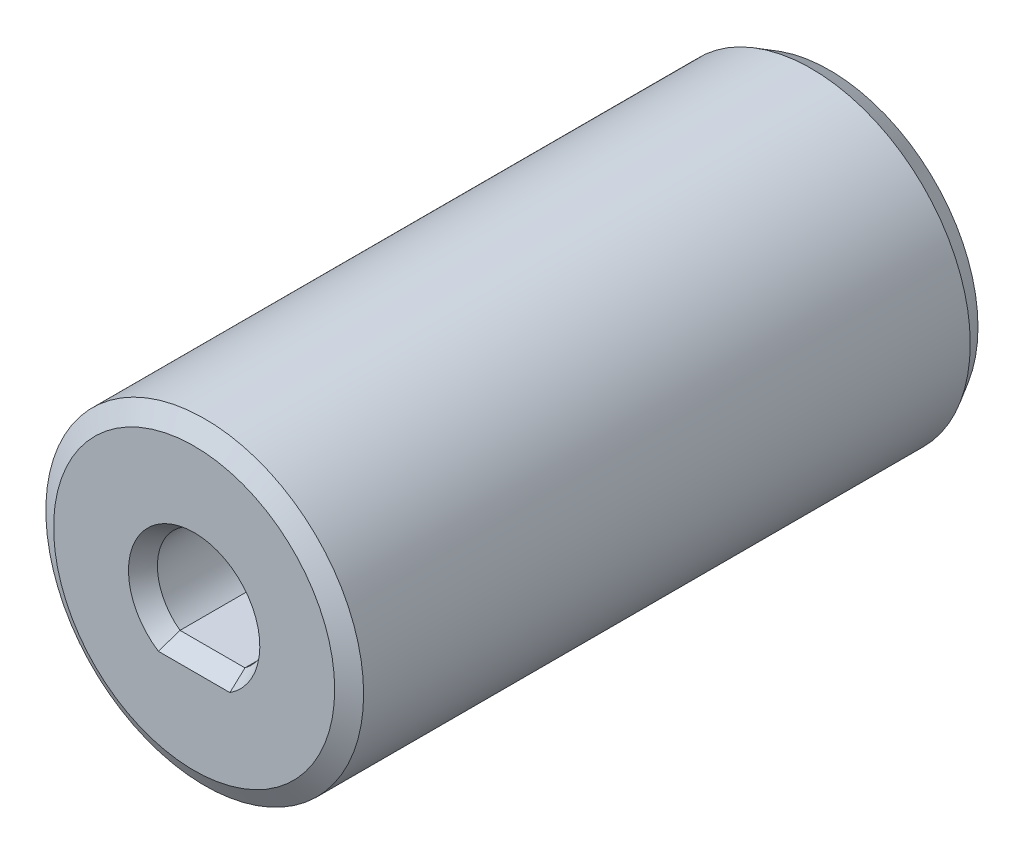
ISO-10303-21;
HEADER;
FILE_DESCRIPTION(('STEP AP214'),'2;1');
FILE_NAME('part.step','',(''),(''),'','','');
FILE_SCHEMA(('AUTOMOTIVE_DESIGN { 1 0 10303 214 1 1 1 1 }'));
ENDSEC;
DATA;
#1=APPLICATION_CONTEXT('core data for automotive mechanical design processes');
#2=APPLICATION_PROTOCOL_DEFINITION('international standard','automotive_design',2000,#1);
#3=PRODUCT_CONTEXT('',#1,'mechanical');
#4=PRODUCT('Part','Part','',(#3));
#5=PRODUCT_RELATED_PRODUCT_CATEGORY('part','',(#4));
#6=PRODUCT_DEFINITION_FORMATION('','',#4);
#7=PRODUCT_DEFINITION_CONTEXT('part definition',#1,'design');
#8=PRODUCT_DEFINITION('design','',#6,#7);
#9=PRODUCT_DEFINITION_SHAPE('','',#8);
#10=(LENGTH_UNIT() NAMED_UNIT(*) SI_UNIT(.MILLI.,.METRE.));
#11=(NAMED_UNIT(*) PLANE_ANGLE_UNIT() SI_UNIT($,.RADIAN.));
#12=(NAMED_UNIT(*) SI_UNIT($,.STERADIAN.) SOLID_ANGLE_UNIT());
#13=UNCERTAINTY_MEASURE_WITH_UNIT(LENGTH_MEASURE(1.E-05),#10,'distance_accuracy_value','');
#14=(GEOMETRIC_REPRESENTATION_CONTEXT(3) GLOBAL_UNCERTAINTY_ASSIGNED_CONTEXT((#13)) GLOBAL_UNIT_ASSIGNED_CONTEXT((#10,
#11,#12)) REPRESENTATION_CONTEXT('',''));
#15=CARTESIAN_POINT('',(0.,0.,0.));
#16=DIRECTION('',(0.,0.,1.));
#17=DIRECTION('',(1.,0.,0.));
#18=AXIS2_PLACEMENT_3D('',#15,#16,#17);
#19=CARTESIAN_POINT('',(0.,0.,0.));
#20=DIRECTION('',(0.,0.,1.));
#21=DIRECTION('',(1.,0.,0.));
#22=AXIS2_PLACEMENT_3D('',#19,#20,#21);
#23=PLANE('',#22);
#24=CARTESIAN_POINT('',(0.,0.,0.));
#25=DIRECTION('',(0.,0.,1.));
#26=DIRECTION('',(1.,0.,0.));
#27=AXIS2_PLACEMENT_3D('',#24,#25,#26);
#28=CIRCLE('',#27,6.99999999999999);
#29=CARTESIAN_POINT('',(6.99999999999999,0.,0.));
#30=VERTEX_POINT('',#29);
#31=EDGE_CURVE('E173',#30,#30,#28,.F.);
#32=ORIENTED_EDGE('',*,*,#31,.T.);
#33=EDGE_LOOP('',(#32));
#34=FACE_BOUND('',#33,.T.);
#35=CARTESIAN_POINT('',(0.,0.,0.));
#36=DIRECTION('',(0.,0.,1.));
#37=DIRECTION('',(1.,0.,0.));
#38=AXIS2_PLACEMENT_3D('',#35,#36,#37);
#39=CIRCLE('',#38,5.81602540378444);
#40=CARTESIAN_POINT('',(5.81602540378444,0.,0.));
#41=VERTEX_POINT('',#40);
#42=EDGE_CURVE('E170',#41,#41,#39,.T.);
#43=ORIENTED_EDGE('',*,*,#42,.T.);
#44=EDGE_LOOP('',(#43));
#45=FACE_BOUND('',#44,.T.);
#46=ADVANCED_FACE('F35',(#34,#45),#23,.F.);
#47=CARTESIAN_POINT('',(0.,0.,30.));
#48=DIRECTION('',(0.,0.,-1.));
#49=DIRECTION('',(-1.,0.,0.));
#50=AXIS2_PLACEMENT_3D('',#47,#48,#49);
#51=CYLINDRICAL_SURFACE('',#50,7.5);
#52=CARTESIAN_POINT('',(0.,0.,29.5));
#53=DIRECTION('',(0.,0.,1.));
#54=DIRECTION('',(1.,0.,0.));
#55=AXIS2_PLACEMENT_3D('',#52,#53,#54);
#56=CIRCLE('',#55,7.5);
#57=CARTESIAN_POINT('',(7.5,0.,29.5));
#58=VERTEX_POINT('',#57);
#59=EDGE_CURVE('E167',#58,#58,#56,.F.);
#60=ORIENTED_EDGE('',*,*,#59,.T.);
#61=EDGE_LOOP('',(#60));
#62=FACE_BOUND('',#61,.T.);
#63=CARTESIAN_POINT('',(0.,0.,0.86602540378445));
#64=DIRECTION('',(0.,0.,1.));
#65=DIRECTION('',(1.,0.,0.));
#66=AXIS2_PLACEMENT_3D('',#63,#64,#65);
#67=CIRCLE('',#66,7.5);
#68=CARTESIAN_POINT('',(7.5,0.,0.86602540378445));
#69=VERTEX_POINT('',#68);
#70=EDGE_CURVE('E164',#69,#69,#67,.T.);
#71=ORIENTED_EDGE('',*,*,#70,.T.);
#72=EDGE_LOOP('',(#71));
#73=FACE_BOUND('',#72,.T.);
#74=CARTESIAN_POINT('',(0.,-7.5,23.8));
#75=CARTESIAN_POINT('',(-0.0669462120767602,-7.49999888052597,23.8000027171781));
#76=CARTESIAN_POINT('',(-0.133929914316201,-7.49909428058238,23.8056211643759));
#77=CARTESIAN_POINT('',(-0.266021267794943,-7.49557274051139,23.8279386686188));
#78=CARTESIAN_POINT('',(-0.331127091681104,-7.49295418758626,23.8446481623401));
#79=CARTESIAN_POINT('',(-0.457532262675773,-7.48629867840773,23.8886325282676));
#80=CARTESIAN_POINT('',(-0.518834581766404,-7.48226284643902,23.9158990276725));
#81=CARTESIAN_POINT('',(-0.635985506607278,-7.47321743880693,23.9802020766387));
#82=CARTESIAN_POINT('',(-0.69183478976936,-7.46820798432512,24.0172374105302));
#83=CARTESIAN_POINT('',(-0.796996497628046,-7.45772185742026,24.1003753625575));
#84=CARTESIAN_POINT('',(-0.846253719915583,-7.45224180265822,24.1465473873671));
#85=CARTESIAN_POINT('',(-0.936356461702698,-7.44145823945629,24.246498680365));
#86=CARTESIAN_POINT('',(-0.977201470144255,-7.43615474175898,24.3002784104012));
#87=CARTESIAN_POINT('',(-1.04953899247928,-7.42629200146917,24.4142943316912));
#88=CARTESIAN_POINT('',(-1.08097739907658,-7.42173713009099,24.474565262417));
#89=CARTESIAN_POINT('',(-1.13326338577564,-7.4139339956973,24.5996173977213));
#90=CARTESIAN_POINT('',(-1.15411162390805,-7.41068565150205,24.6643983217825));
#91=CARTESIAN_POINT('',(-1.18445255208796,-7.40589686845418,24.7960482261189));
#92=CARTESIAN_POINT('',(-1.1940402267024,-7.40434215180217,24.86289478657));
#93=CARTESIAN_POINT('',(-1.20188226802546,-7.40307340295467,24.9972645922513));
#94=CARTESIAN_POINT('',(-1.20013737416515,-7.40335925066543,25.0647877930447));
#95=CARTESIAN_POINT('',(-1.18544128234881,-7.40572628883623,25.1979190182994));
#96=CARTESIAN_POINT('',(-1.17259640835848,-7.4077904447506,25.2635391264166));
#97=CARTESIAN_POINT('',(-1.13623166108304,-7.41345487921042,25.3916806426588));
#98=CARTESIAN_POINT('',(-1.11271144797403,-7.417055206656,25.4542019520705));
#99=CARTESIAN_POINT('',(-1.05555473248324,-7.42540489095961,25.5746915607135));
#100=CARTESIAN_POINT('',(-1.02187371490505,-7.43015928558415,25.6326383798112));
#101=CARTESIAN_POINT('',(-0.945383115794174,-7.44027784868954,25.7420981630112));
#102=CARTESIAN_POINT('',(-0.902572854093217,-7.44564206259067,25.7936106472739));
#103=CARTESIAN_POINT('',(-0.80845790452735,-7.45645087471523,25.8893552802624));
#104=CARTESIAN_POINT('',(-0.757061913273593,-7.46189569201626,25.9334977042413));
#105=CARTESIAN_POINT('',(-0.647544224808313,-7.47219556250799,26.0125448433058));
#106=CARTESIAN_POINT('',(-0.589422490329827,-7.47705061243052,26.047449507202));
#107=CARTESIAN_POINT('',(-0.468021532985471,-7.48563003419664,26.1070370068684));
#108=CARTESIAN_POINT('',(-0.404738560452918,-7.48935357454238,26.1317123303613));
#109=CARTESIAN_POINT('',(-0.274853900363861,-7.49524365356161,26.1700596147556));
#110=CARTESIAN_POINT('',(-0.208252468842436,-7.49741031215769,26.1837324231622));
#111=CARTESIAN_POINT('',(-0.0743952332411797,-7.49992647873036,26.1995658820078));
#112=CARTESIAN_POINT('',(-0.0071543601962608,-7.5002954398054,26.2018497795746));
#113=CARTESIAN_POINT('',(0.126749622906687,-7.49922778505598,26.1951685710344));
#114=CARTESIAN_POINT('',(0.193412753312574,-7.49779123308329,26.1862038627332));
#115=CARTESIAN_POINT('',(0.323891278941306,-7.49328600091403,26.1573824210865));
#116=CARTESIAN_POINT('',(0.38772040464125,-7.49022640681533,26.1375863048173));
#117=CARTESIAN_POINT('',(0.511153794351598,-7.48281687688657,26.087728318882));
#118=CARTESIAN_POINT('',(0.570757836594716,-7.4784668733872,26.0576659108371));
#119=CARTESIAN_POINT('',(0.684587190677323,-7.46891112911056,25.987843600418));
#120=CARTESIAN_POINT('',(0.738764401857423,-7.46369866534985,25.9480062183862));
#121=CARTESIAN_POINT('',(0.839708493837172,-7.45301757248224,25.8598719073825));
#122=CARTESIAN_POINT('',(0.886474880641698,-7.44754892633002,25.811574414923));
#123=CARTESIAN_POINT('',(0.971723199180005,-7.43690941638441,25.7073397671376));
#124=CARTESIAN_POINT('',(1.01012212448832,-7.43174187872268,25.6513343327279));
#125=CARTESIAN_POINT('',(1.07696693526072,-7.42235046181047,25.5335957313278));
#126=CARTESIAN_POINT('',(1.10541311774301,-7.41812655440073,25.4718627353337));
#127=CARTESIAN_POINT('',(1.15141895012492,-7.41112524722868,25.3446598244691));
#128=CARTESIAN_POINT('',(1.1690208894151,-7.40834223526334,25.2792055272413));
#129=CARTESIAN_POINT('',(1.19297231132676,-7.40452339332433,25.1462214580048));
#130=CARTESIAN_POINT('',(1.19932268849073,-7.40348742445431,25.0786918514255));
#131=CARTESIAN_POINT('',(1.20056727971036,-7.40328562551415,24.944302303938));
#132=CARTESIAN_POINT('',(1.19559208692868,-7.40409847692991,24.8774435682761));
#133=CARTESIAN_POINT('',(1.17460810783785,-7.40745616954927,24.7455272064237));
#134=CARTESIAN_POINT('',(1.15859934946717,-7.41000100636725,24.6804695756729));
#135=CARTESIAN_POINT('',(1.11605113113038,-7.41652809517206,24.5540467899901));
#136=CARTESIAN_POINT('',(1.0895220466208,-7.42050893058618,24.4926780654152));
#137=CARTESIAN_POINT('',(1.02669946370546,-7.42946098604448,24.3752413193962));
#138=CARTESIAN_POINT('',(0.990405543747041,-7.43443224884349,24.3191735269371));
#139=CARTESIAN_POINT('',(0.908613981598058,-7.44487300846208,24.2132688514981));
#140=CARTESIAN_POINT('',(0.863019987485752,-7.45034736130681,24.1635068512598));
#141=CARTESIAN_POINT('',(0.764126006147714,-7.46113800779853,24.0722947711615));
#142=CARTESIAN_POINT('',(0.710824238412025,-7.46645426458198,24.0308466171108));
#143=CARTESIAN_POINT('',(0.597629007946397,-7.47636843377491,23.9572015202969));
#144=CARTESIAN_POINT('',(0.537696029876905,-7.48096159591775,23.9250646756676));
#145=CARTESIAN_POINT('',(0.41323510018119,-7.48886572502808,23.8713632242606));
#146=CARTESIAN_POINT('',(0.348711876725849,-7.49217798937398,23.8497879141376));
#147=CARTESIAN_POINT('',(0.236601311302821,-7.49641053537834,23.8225925567587));
#148=CARTESIAN_POINT('',(0.189698086499212,-7.49774950669905,23.8141336583243));
#149=CARTESIAN_POINT('',(0.0952028880910206,-7.49954463040284,23.8028364562818));
#150=CARTESIAN_POINT('',(0.0476109249232957,-7.50000079614951,23.7999980675925));
#151=CARTESIAN_POINT('',(0.,-7.5,23.8));
#152=B_SPLINE_CURVE_WITH_KNOTS('',3,(#74,#75,#76,#77,#78,#79,#80,#81,#82,#83,#84,#85,#86,#87,
#88,#89,#90,#91,#92,#93,#94,#95,#96,#97,#98,#99,#100,#101,#102,#103,#104,#105,#106,#107,#108,
#109,#110,#111,#112,#113,#114,#115,#116,#117,#118,#119,#120,#121,#122,#123,#124,#125,#126,#127,
#128,#129,#130,#131,#132,#133,#134,#135,#136,#137,#138,#139,#140,#141,#142,#143,#144,#145,#146,
#147,#148,#149,#150,#151),.UNSPECIFIED.,.T.,.F.,(4,2,2,2,2,2,2,2,2,2,2,2,2,2,2,2,2,2,2,2,2,2,2,
2,2,2,2,2,2,2,2,2,2,2,2,2,2,2,4),(0.,0.200664627973767,0.40151834959168,0.602213098594111,
0.802882884174625,1.0051400076494,1.20740941500768,1.41082085775567,1.61421965978482,
1.8158901508179,2.01754748332216,2.217294335343,2.41704754627315,2.61768892240991,
2.8183452524249,3.02128988002434,3.22423563218232,3.42733016181611,3.63040904592116,
3.83128543290068,4.0321547161088,4.23191118136228,4.43167812373353,4.63308275570306,
4.83450080737962,5.03783416251962,5.24116144909512,5.44369071456188,5.64620387745015,
5.84639374107685,6.04658309779789,6.24657551092056,6.4465765591979,6.64876578512427,
6.8510017919684,7.05451541190141,7.25782235642109,7.40053354001991,7.54324256329169),.UNSPECIFIED.);
#153=CARTESIAN_POINT('',(0.,-7.5,23.8));
#154=VERTEX_POINT('',#153);
#155=EDGE_CURVE('E358',#154,#154,#152,.T.);
#156=ORIENTED_EDGE('',*,*,#155,.T.);
#157=EDGE_LOOP('',(#156));
#158=FACE_BOUND('',#157,.T.);
#159=CARTESIAN_POINT('',(0.,-7.5,3.8));
#160=CARTESIAN_POINT('',(-0.0669462120767602,-7.49999888052597,3.80000271717811));
#161=CARTESIAN_POINT('',(-0.133929914316201,-7.49909428058238,3.8056211643759));
#162=CARTESIAN_POINT('',(-0.266021267794943,-7.49557274051139,3.82793866861879));
#163=CARTESIAN_POINT('',(-0.331127091681104,-7.49295418758626,3.84464816234009));
#164=CARTESIAN_POINT('',(-0.457532262675773,-7.48629867840773,3.88863252826761));
#165=CARTESIAN_POINT('',(-0.518834581766403,-7.48226284643902,3.91589902767247));
#166=CARTESIAN_POINT('',(-0.635985506607277,-7.47321743880693,3.98020207663867));
#167=CARTESIAN_POINT('',(-0.691834789769359,-7.46820798432512,4.01723741053018));
#168=CARTESIAN_POINT('',(-0.796996497628045,-7.45772185742026,4.10037536255746));
#169=CARTESIAN_POINT('',(-0.846253719915582,-7.45224180265822,4.1465473873671));
#170=CARTESIAN_POINT('',(-0.936356461702697,-7.44145823945629,4.24649868036498));
#171=CARTESIAN_POINT('',(-0.977201470144254,-7.43615474175898,4.30027841040121));
#172=CARTESIAN_POINT('',(-1.04953899247928,-7.42629200146917,4.41429433169124));
#173=CARTESIAN_POINT('',(-1.08097739907658,-7.42173713009099,4.47456526241696));
#174=CARTESIAN_POINT('',(-1.13326338577564,-7.4139339956973,4.59961739772128));
#175=CARTESIAN_POINT('',(-1.15411162390805,-7.41068565150205,4.66439832178249));
#176=CARTESIAN_POINT('',(-1.18445255208796,-7.40589686845418,4.79604822611889));
#177=CARTESIAN_POINT('',(-1.1940402267024,-7.40434215180217,4.86289478657002));
#178=CARTESIAN_POINT('',(-1.20188226802546,-7.40307340295467,4.99726459225127));
#179=CARTESIAN_POINT('',(-1.20013737416515,-7.40335925066543,5.0647877930447));
#180=CARTESIAN_POINT('',(-1.18544128234881,-7.40572628883623,5.19791901829936));
#181=CARTESIAN_POINT('',(-1.17259640835849,-7.4077904447506,5.26353912641662));
#182=CARTESIAN_POINT('',(-1.13623166108304,-7.41345487921042,5.39168064265878));
#183=CARTESIAN_POINT('',(-1.11271144797403,-7.417055206656,5.45420195207054));
#184=CARTESIAN_POINT('',(-1.05555473248324,-7.42540489095961,5.57469156071351));
#185=CARTESIAN_POINT('',(-1.02187371490505,-7.43015928558415,5.63263837981123));
#186=CARTESIAN_POINT('',(-0.945383115794176,-7.44027784868954,5.7420981630112));
#187=CARTESIAN_POINT('',(-0.902572854093219,-7.44564206259067,5.79361064727391));
#188=CARTESIAN_POINT('',(-0.808457904527351,-7.45645087471523,5.88935528026241));
#189=CARTESIAN_POINT('',(-0.757061913273594,-7.46189569201626,5.93349770424127));
#190=CARTESIAN_POINT('',(-0.647544224808313,-7.47219556250799,6.01254484330581));
#191=CARTESIAN_POINT('',(-0.589422490329827,-7.47705061243052,6.04744950720204));
#192=CARTESIAN_POINT('',(-0.468021532985471,-7.48563003419664,6.10703700686839));
#193=CARTESIAN_POINT('',(-0.404738560452918,-7.48935357454238,6.13171233036132));
#194=CARTESIAN_POINT('',(-0.274853900363862,-7.49524365356161,6.17005961475561));
#195=CARTESIAN_POINT('',(-0.208252468842437,-7.49741031215769,6.18373242316224));
#196=CARTESIAN_POINT('',(-0.0743952332411813,-7.49992647873036,6.19956588200778));
#197=CARTESIAN_POINT('',(-0.00715436019626228,-7.5002954398054,6.2018497795746));
#198=CARTESIAN_POINT('',(0.126749622906686,-7.49922778505598,6.19516857103444));
#199=CARTESIAN_POINT('',(0.193412753312573,-7.49779123308329,6.18620386273319));
#200=CARTESIAN_POINT('',(0.323891278941305,-7.49328600091403,6.15738242108645));
#201=CARTESIAN_POINT('',(0.38772040464125,-7.49022640681533,6.13758630481727));
#202=CARTESIAN_POINT('',(0.511153794351597,-7.48281687688657,6.08772831888197));
#203=CARTESIAN_POINT('',(0.570757836594715,-7.4784668733872,6.05766591083714));
#204=CARTESIAN_POINT('',(0.684587190677322,-7.46891112911056,5.98784360041801));
#205=CARTESIAN_POINT('',(0.738764401857422,-7.46369866534985,5.94800621838616));
#206=CARTESIAN_POINT('',(0.83970849383717,-7.45301757248224,5.85987190738249));
#207=CARTESIAN_POINT('',(0.886474880641697,-7.44754892633002,5.81157441492305));
#208=CARTESIAN_POINT('',(0.971723199180003,-7.43690941638441,5.70733976713763));
#209=CARTESIAN_POINT('',(1.01012212448832,-7.43174187872268,5.65133433272791));
#210=CARTESIAN_POINT('',(1.07696693526072,-7.42235046181047,5.5335957313278));
#211=CARTESIAN_POINT('',(1.10541311774301,-7.41812655440073,5.47186273533374));
#212=CARTESIAN_POINT('',(1.15141895012492,-7.41112524722868,5.34465982446907));
#213=CARTESIAN_POINT('',(1.1690208894151,-7.40834223526335,5.27920552724128));
#214=CARTESIAN_POINT('',(1.19297231132676,-7.40452339332433,5.14622145800479));
#215=CARTESIAN_POINT('',(1.19932268849073,-7.40348742445431,5.0786918514255));
#216=CARTESIAN_POINT('',(1.20056727971036,-7.40328562551415,4.94430230393803));
#217=CARTESIAN_POINT('',(1.19559208692868,-7.40409847692991,4.87744356827614));
#218=CARTESIAN_POINT('',(1.17460810783785,-7.40745616954927,4.74552720642366));
#219=CARTESIAN_POINT('',(1.15859934946717,-7.41000100636725,4.68046957567286));
#220=CARTESIAN_POINT('',(1.11605113113038,-7.41652809517206,4.55404678999012));
#221=CARTESIAN_POINT('',(1.0895220466208,-7.42050893058618,4.49267806541521));
#222=CARTESIAN_POINT('',(1.02669946370546,-7.42946098604448,4.37524131939616));
#223=CARTESIAN_POINT('',(0.990405543747042,-7.43443224884349,4.31917352693706));
#224=CARTESIAN_POINT('',(0.908613981598059,-7.44487300846208,4.21326885149807));
#225=CARTESIAN_POINT('',(0.863019987485753,-7.45034736130681,4.16350685125975));
#226=CARTESIAN_POINT('',(0.764126006147715,-7.46113800779853,4.07229477116149));
#227=CARTESIAN_POINT('',(0.710824238412025,-7.46645426458198,4.03084661711078));
#228=CARTESIAN_POINT('',(0.597629007946398,-7.47636843377491,3.95720152029691));
#229=CARTESIAN_POINT('',(0.537696029876906,-7.48096159591775,3.92506467566756));
#230=CARTESIAN_POINT('',(0.413235100181192,-7.48886572502808,3.87136322426055));
#231=CARTESIAN_POINT('',(0.348711876725851,-7.49217798937398,3.84978791413762));
#232=CARTESIAN_POINT('',(0.236601311302822,-7.49641053537834,3.82259255675872));
#233=CARTESIAN_POINT('',(0.189698086499214,-7.49774950669905,3.81413365832432));
#234=CARTESIAN_POINT('',(0.095202888091021,-7.49954463040284,3.80283645628184));
#235=CARTESIAN_POINT('',(0.0476109249232959,-7.50000079614951,3.79999806759249));
#236=CARTESIAN_POINT('',(0.,-7.5,3.8));
#237=B_SPLINE_CURVE_WITH_KNOTS('',3,(#159,#160,#161,#162,#163,#164,#165,#166,#167,#168,#169,
#170,#171,#172,#173,#174,#175,#176,#177,#178,#179,#180,#181,#182,#183,#184,#185,#186,#187,#188,
#189,#190,#191,#192,#193,#194,#195,#196,#197,#198,#199,#200,#201,#202,#203,#204,#205,#206,#207,
#208,#209,#210,#211,#212,#213,#214,#215,#216,#217,#218,#219,#220,#221,#222,#223,#224,#225,#226,
#227,#228,#229,#230,#231,#232,#233,#234,#235,#236),.UNSPECIFIED.,.T.,.F.,(4,2,2,2,2,2,2,2,2,2,2,
2,2,2,2,2,2,2,2,2,2,2,2,2,2,2,2,2,2,2,2,2,2,2,2,2,2,2,4),(0.,0.200664627973767,0.40151834959168,
0.602213098594112,0.802882884174623,1.0051400076494,1.20740941500768,1.41082085775567,
1.61421965978482,1.8158901508179,2.01754748332216,2.217294335343,2.41704754627315,
2.61768892240991,2.8183452524249,3.02128988002434,3.22423563218232,3.42733016181611,
3.63040904592116,3.83128543290068,4.0321547161088,4.23191118136228,4.43167812373353,
4.63308275570306,4.83450080737962,5.03783416251962,5.24116144909512,5.44369071456188,
5.64620387745016,5.84639374107684,6.04658309779789,6.24657551092056,6.4465765591979,
6.64876578512427,6.8510017919684,7.05451541190141,7.25782235642109,7.40053354001991,
7.54324256329169),.UNSPECIFIED.);
#238=CARTESIAN_POINT('',(0.,-7.5,3.8));
#239=VERTEX_POINT('',#238);
#240=EDGE_CURVE('E125',#239,#239,#237,.T.);
#241=ORIENTED_EDGE('',*,*,#240,.T.);
#242=EDGE_LOOP('',(#241));
#243=FACE_BOUND('',#242,.T.);
#244=ADVANCED_FACE('F261',(#62,#73,#158,#243),#51,.T.);
#245=CARTESIAN_POINT('',(0.,0.,30.));
#246=DIRECTION('',(0.,0.,1.));
#247=DIRECTION('',(1.,0.,0.));
#248=AXIS2_PLACEMENT_3D('',#245,#246,#247);
#249=PLANE('',#248);
#250=CARTESIAN_POINT('',(0.,0.,30.));
#251=DIRECTION('',(0.,0.,1.));
#252=DIRECTION('',(1.,0.,0.));
#253=AXIS2_PLACEMENT_3D('',#250,#251,#252);
#254=CIRCLE('',#253,6.63397459621556);
#255=CARTESIAN_POINT('',(6.63397459621556,0.,30.));
#256=VERTEX_POINT('',#255);
#257=EDGE_CURVE('E161',#256,#256,#254,.T.);
#258=ORIENTED_EDGE('',*,*,#257,.T.);
#259=EDGE_LOOP('',(#258));
#260=FACE_BOUND('',#259,.T.);
#261=CARTESIAN_POINT('',(0.,0.,30.));
#262=DIRECTION('',(0.,0.,1.));
#263=DIRECTION('',(1.,0.,0.));
#264=AXIS2_PLACEMENT_3D('',#261,#262,#263);
#265=CIRCLE('',#264,3.1);
#266=CARTESIAN_POINT('',(-1.68819430161341,-2.6,30.));
#267=VERTEX_POINT('',#266);
#268=CARTESIAN_POINT('',(1.68819430161341,-2.6,30.));
#269=VERTEX_POINT('',#268);
#270=EDGE_CURVE('E156',#267,#269,#265,.F.);
#271=ORIENTED_EDGE('',*,*,#270,.T.);
#272=DIRECTION('',(-1.,0.,0.));
#273=VECTOR('',#272,1.);
#274=CARTESIAN_POINT('',(-1.53297097167559,-2.6,30.));
#275=LINE('',#274,#273);
#276=EDGE_CURVE('E158',#269,#267,#275,.T.);
#277=ORIENTED_EDGE('',*,*,#276,.T.);
#278=EDGE_LOOP('',(#271,#277));
#279=FACE_BOUND('',#278,.T.);
#280=ADVANCED_FACE('F268',(#260,#279),#249,.T.);
#281=CARTESIAN_POINT('',(0.,0.,10.));
#282=DIRECTION('',(0.,0.,1.));
#283=DIRECTION('',(1.,0.,0.));
#284=AXIS2_PLACEMENT_3D('',#281,#282,#283);
#285=PLANE('',#284);
#286=CARTESIAN_POINT('',(0.,0.,10.));
#287=DIRECTION('',(0.,0.,1.));
#288=DIRECTION('',(1.,0.,0.));
#289=AXIS2_PLACEMENT_3D('',#286,#287,#288);
#290=CIRCLE('',#289,4.95);
#291=CARTESIAN_POINT('',(4.95,0.,10.));
#292=VERTEX_POINT('',#291);
#293=EDGE_CURVE('E153',#292,#292,#290,.T.);
#294=ORIENTED_EDGE('',*,*,#293,.F.);
#295=EDGE_LOOP('',(#294));
#296=FACE_BOUND('',#295,.T.);
#297=DIRECTION('',(-1.,0.,0.));
#298=VECTOR('',#297,1.);
#299=CARTESIAN_POINT('',(1.9672315572906,1.7,10.));
#300=LINE('',#299,#298);
#301=CARTESIAN_POINT('',(1.9672315572906,1.7,10.));
#302=VERTEX_POINT('',#301);
#303=CARTESIAN_POINT('',(-1.9672315572906,1.7,10.));
#304=VERTEX_POINT('',#303);
#305=EDGE_CURVE('E134',#302,#304,#300,.T.);
#306=ORIENTED_EDGE('',*,*,#305,.T.);
#307=CARTESIAN_POINT('',(0.,0.,10.));
#308=DIRECTION('',(0.,0.,1.));
#309=DIRECTION('',(1.,0.,0.));
#310=AXIS2_PLACEMENT_3D('',#307,#308,#309);
#311=CIRCLE('',#310,2.6);
#312=CARTESIAN_POINT('',(-1.9672315572906,-1.7,10.));
#313=VERTEX_POINT('',#312);
#314=EDGE_CURVE('E136',#304,#313,#311,.T.);
#315=ORIENTED_EDGE('',*,*,#314,.T.);
#316=DIRECTION('',(1.,0.,0.));
#317=VECTOR('',#316,1.);
#318=CARTESIAN_POINT('',(1.9672315572906,-1.7,10.));
#319=LINE('',#318,#317);
#320=CARTESIAN_POINT('',(1.9672315572906,-1.7,10.));
#321=VERTEX_POINT('',#320);
#322=EDGE_CURVE('E139',#313,#321,#319,.T.);
#323=ORIENTED_EDGE('',*,*,#322,.T.);
#324=CARTESIAN_POINT('',(0.,0.,10.));
#325=DIRECTION('',(0.,0.,1.));
#326=DIRECTION('',(1.,0.,0.));
#327=AXIS2_PLACEMENT_3D('',#324,#325,#326);
#328=CIRCLE('',#327,2.6);
#329=EDGE_CURVE('E131',#321,#302,#328,.T.);
#330=ORIENTED_EDGE('',*,*,#329,.T.);
#331=EDGE_LOOP('',(#306,#315,#323,#330));
#332=FACE_BOUND('',#331,.T.);
#333=ADVANCED_FACE('F302',(#296,#332),#285,.F.);
#334=CARTESIAN_POINT('',(0.,0.,10.));
#335=DIRECTION('',(0.,0.,-1.));
#336=DIRECTION('',(-1.,0.,0.));
#337=AXIS2_PLACEMENT_3D('',#334,#335,#336);
#338=CYLINDRICAL_SURFACE('',#337,4.95);
#339=CARTESIAN_POINT('',(0.,0.,0.5));
#340=DIRECTION('',(0.,0.,1.));
#341=DIRECTION('',(1.,0.,0.));
#342=AXIS2_PLACEMENT_3D('',#339,#340,#341);
#343=CIRCLE('',#342,4.95);
#344=CARTESIAN_POINT('',(4.95,0.,0.5));
#345=VERTEX_POINT('',#344);
#346=EDGE_CURVE('E194',#345,#345,#343,.F.);
#347=ORIENTED_EDGE('',*,*,#346,.T.);
#348=EDGE_LOOP('',(#347));
#349=FACE_BOUND('',#348,.T.);
#350=CARTESIAN_POINT('',(0.,-4.95,3.8));
#351=CARTESIAN_POINT('',(-0.0663653285853242,-4.94999883928221,3.80000197510329));
#352=CARTESIAN_POINT('',(-0.132753148151543,-4.94865198066441,3.8055239875429));
#353=CARTESIAN_POINT('',(-0.263630389399926,-4.94340948809397,3.82743564594397));
#354=CARTESIAN_POINT('',(-0.328118639549366,-4.93951231429562,3.84383185768003));
#355=CARTESIAN_POINT('',(-0.453287492173618,-4.92960134689587,3.8869382148729));
#356=CARTESIAN_POINT('',(-0.513972423416976,-4.92359001304616,3.91363637786019));
#357=CARTESIAN_POINT('',(-0.630001572998149,-4.91009309634401,3.97654763594758));
#358=CARTESIAN_POINT('',(-0.685345689936394,-4.90260748550947,4.01276091165103));
#359=CARTESIAN_POINT('',(-0.790199236189716,-4.88681375066297,4.09441884204251));
#360=CARTESIAN_POINT('',(-0.839589956130603,-4.87849355017332,4.14001359999122));
#361=CARTESIAN_POINT('',(-0.93010354102088,-4.8620498088231,4.23881863377434));
#362=CARTESIAN_POINT('',(-0.971225525526845,-4.85392628898572,4.29202971955319));
#363=CARTESIAN_POINT('',(-1.04458382419297,-4.83867465530276,4.40546749786568));
#364=CARTESIAN_POINT('',(-1.07668897693139,-4.83156191127732,4.46578126373663));
#365=CARTESIAN_POINT('',(-1.13025934295189,-4.81931261486038,4.59114974944363));
#366=CARTESIAN_POINT('',(-1.15172614628402,-4.81417576716925,4.65620375911575));
#367=CARTESIAN_POINT('',(-1.18300867028473,-4.80658373157017,4.78790505434245));
#368=CARTESIAN_POINT('',(-1.19303702903832,-4.80407967209874,4.85449895135808));
#369=CARTESIAN_POINT('',(-1.20182004946411,-4.80189032550955,4.98846737717323));
#370=CARTESIAN_POINT('',(-1.20057642940653,-4.80220460877109,5.05584178542994));
#371=CARTESIAN_POINT('',(-1.18702081774214,-4.80557242578429,5.18784169222787));
#372=CARTESIAN_POINT('',(-1.1749605581602,-4.80856365641107,5.25249487812687));
#373=CARTESIAN_POINT('',(-1.14051488310091,-4.81684924326627,5.37883188436466));
#374=CARTESIAN_POINT('',(-1.11812877132475,-4.82214375480948,5.44051550414812));
#375=CARTESIAN_POINT('',(-1.06344816764788,-4.83449758941742,5.55984566167409));
#376=CARTESIAN_POINT('',(-1.03106094901539,-4.84157330871782,5.61744794069979));
#377=CARTESIAN_POINT('',(-0.95736241808358,-4.85668284965802,5.72649123711638));
#378=CARTESIAN_POINT('',(-0.916049630499965,-4.86471682958781,5.77793123377194));
#379=CARTESIAN_POINT('',(-0.824361460467806,-4.88110127290572,5.87463413100935));
#380=CARTESIAN_POINT('',(-0.773773218960243,-4.889454453469,5.91969499026293));
#381=CARTESIAN_POINT('',(-0.665659185750701,-4.90534183603599,6.00073057514442));
#382=CARTESIAN_POINT('',(-0.608133206343822,-4.91287601587061,6.03670505485304));
#383=CARTESIAN_POINT('',(-0.487498992383242,-4.92631043883738,6.09861462181725));
#384=CARTESIAN_POINT('',(-0.42437414141745,-4.9322055880058,6.12451850774583));
#385=CARTESIAN_POINT('',(-0.294491588961402,-4.9416605273799,6.16529197838412));
#386=CARTESIAN_POINT('',(-0.227734542077087,-4.94522073689598,6.18016354434999));
#387=CARTESIAN_POINT('',(-0.0942114104676502,-4.94954320433643,6.19814541146704));
#388=CARTESIAN_POINT('',(-0.0274844738604486,-4.95037095285824,6.2015310588484));
#389=CARTESIAN_POINT('',(0.105582193858072,-4.94932099923216,6.19719792672968));
#390=CARTESIAN_POINT('',(0.171921957140691,-4.94744352517717,6.18948008342898));
#391=CARTESIAN_POINT('',(0.301385604122835,-4.94123589414257,6.16338641537171));
#392=CARTESIAN_POINT('',(0.364541258326511,-4.9369399871841,6.14515933782735));
#393=CARTESIAN_POINT('',(0.4868962981609,-4.92637862719501,6.09873328162484));
#394=CARTESIAN_POINT('',(0.546095297894495,-4.92011298239248,6.07053333198342));
#395=CARTESIAN_POINT('',(0.659963104650573,-4.9061489808967,6.00441831932727));
#396=CARTESIAN_POINT('',(0.714538438051283,-4.89842819986792,5.96634711765376));
#397=CARTESIAN_POINT('',(0.816623887047512,-4.88244813799256,5.8817713673563));
#398=CARTESIAN_POINT('',(0.864132857833652,-4.87418877020154,5.83526545494194));
#399=CARTESIAN_POINT('',(0.951860208246623,-4.85782902696036,5.73386534213653));
#400=CARTESIAN_POINT('',(0.991886005635799,-4.84973666425732,5.67880296684912));
#401=CARTESIAN_POINT('',(1.06212732438771,-4.83484021047181,5.56257902116317));
#402=CARTESIAN_POINT('',(1.09234328481451,-4.82803606173775,5.50141772389751));
#403=CARTESIAN_POINT('',(1.14188564037697,-4.81655937201139,5.37506461360434));
#404=CARTESIAN_POINT('',(1.16127640928546,-4.81187426214481,5.3098992416807));
#405=CARTESIAN_POINT('',(1.18879342287338,-4.80515083927312,5.17710361746526));
#406=CARTESIAN_POINT('',(1.19692195730858,-4.80311198825521,5.1094738690831));
#407=CARTESIAN_POINT('',(1.20156957409558,-4.80195117835779,4.97562411875191));
#408=CARTESIAN_POINT('',(1.19839577851333,-4.80275205208933,4.90941527404261));
#409=CARTESIAN_POINT('',(1.18122759040968,-4.80700302474056,4.77850681567534));
#410=CARTESIAN_POINT('',(1.16723339077343,-4.81045307643584,4.71380717513538));
#411=CARTESIAN_POINT('',(1.12898467147446,-4.8195719839479,4.5880648151186));
#412=CARTESIAN_POINT('',(1.10478449560002,-4.82522907614806,4.52700465394728));
#413=CARTESIAN_POINT('',(1.04685438254076,-4.83812697345376,4.4097690585485));
#414=CARTESIAN_POINT('',(1.01312320320029,-4.84536798496037,4.35359426226919));
#415=CARTESIAN_POINT('',(0.936111659719278,-4.86084055138459,4.24623216877912));
#416=CARTESIAN_POINT('',(0.892616695585166,-4.86909209996408,4.195201659806));
#417=CARTESIAN_POINT('',(0.797734772203932,-4.88553305496984,4.10106364381006));
#418=CARTESIAN_POINT('',(0.746345957510289,-4.89372244630993,4.05795800477149));
#419=CARTESIAN_POINT('',(0.636096386949749,-4.90927984359505,3.98019225131777));
#420=CARTESIAN_POINT('',(0.577124901737639,-4.91663179520298,3.94568567968814));
#421=CARTESIAN_POINT('',(0.454046934753577,-4.92951895856065,3.88713074421183));
#422=CARTESIAN_POINT('',(0.389944337879386,-4.93505552889535,3.86307455516521));
#423=CARTESIAN_POINT('',(0.271589403668396,-4.94282591625394,3.82985879690184));
#424=CARTESIAN_POINT('',(0.217922028271319,-4.94549819142884,3.81868520250148));
#425=CARTESIAN_POINT('',(0.109508158616434,-4.94908565392957,3.8037552350956));
#426=CARTESIAN_POINT('',(0.0547617361614048,-4.95000095777302,3.79999837023206));
#427=CARTESIAN_POINT('',(0.,-4.95,3.8));
#428=B_SPLINE_CURVE_WITH_KNOTS('',3,(#350,#351,#352,#353,#354,#355,#356,#357,#358,#359,#360,
#361,#362,#363,#364,#365,#366,#367,#368,#369,#370,#371,#372,#373,#374,#375,#376,#377,#378,#379,
#380,#381,#382,#383,#384,#385,#386,#387,#388,#389,#390,#391,#392,#393,#394,#395,#396,#397,#398,
#399,#400,#401,#402,#403,#404,#405,#406,#407,#408,#409,#410,#411,#412,#413,#414,#415,#416,#417,
#418,#419,#420,#421,#422,#423,#424,#425,#426,#427),.UNSPECIFIED.,.T.,.F.,(4,2,2,2,2,2,2,2,2,2,2,
2,2,2,2,2,2,2,2,2,2,2,2,2,2,2,2,2,2,2,2,2,2,2,2,2,2,2,4),(0.,0.198895364609659,
0.397910930481681,0.59669571051228,0.795484263886431,0.997742743658117,1.20002274823987,
1.40510850266058,1.61016359489602,1.81134123939209,2.01248821742333,2.2090720670865,
2.40566917484325,2.6041467580726,2.8026571722829,3.00647763948952,3.21030362242583,
3.41475617228624,3.61917199632637,3.81865145371821,4.01811409283179,4.21482052781195,
4.41154611988816,4.61159654130007,4.81167933732104,5.01635910455508,5.22102970956526,
5.42446987696821,5.62786867632035,5.82578312676049,6.02369404924743,6.22056420142508,
6.41746002311993,6.61920204788273,6.82099156479577,7.02616077907064,7.23117609762516,
7.39530664747863,7.55942631225927),.UNSPECIFIED.);
#429=CARTESIAN_POINT('',(0.,-4.95,3.8));
#430=VERTEX_POINT('',#429);
#431=EDGE_CURVE('E364',#430,#430,#428,.T.);
#432=ORIENTED_EDGE('',*,*,#431,.F.);
#433=EDGE_LOOP('',(#432));
#434=FACE_BOUND('',#433,.T.);
#435=ORIENTED_EDGE('',*,*,#293,.T.);
#436=EDGE_LOOP('',(#435));
#437=FACE_BOUND('',#436,.T.);
#438=ADVANCED_FACE('F314',(#349,#434,#437),#338,.F.);
#439=CARTESIAN_POINT('',(0.,0.,10.));
#440=DIRECTION('',(0.,0.,-1.));
#441=DIRECTION('',(-1.,0.,0.));
#442=AXIS2_PLACEMENT_3D('',#439,#440,#441);
#443=CYLINDRICAL_SURFACE('',#442,2.6);
#444=DIRECTION('',(0.,0.,-1.));
#445=VECTOR('',#444,1.);
#446=CARTESIAN_POINT('',(1.9672315572906,-1.7,10.));
#447=LINE('',#446,#445);
#448=CARTESIAN_POINT('',(1.9672315572906,-1.7,0.866025403784436));
#449=VERTEX_POINT('',#448);
#450=EDGE_CURVE('E141',#321,#449,#447,.T.);
#451=ORIENTED_EDGE('',*,*,#450,.T.);
#452=CARTESIAN_POINT('',(0.,0.,0.866025403784436));
#453=DIRECTION('',(0.,0.,1.));
#454=DIRECTION('',(1.,0.,0.));
#455=AXIS2_PLACEMENT_3D('',#452,#453,#454);
#456=CIRCLE('',#455,2.6);
#457=CARTESIAN_POINT('',(1.9672315572906,1.7,0.866025403784436));
#458=VERTEX_POINT('',#457);
#459=EDGE_CURVE('E190',#449,#458,#456,.T.);
#460=ORIENTED_EDGE('',*,*,#459,.T.);
#461=DIRECTION('',(0.,0.,-1.));
#462=VECTOR('',#461,1.);
#463=CARTESIAN_POINT('',(1.9672315572906,1.7,10.));
#464=LINE('',#463,#462);
#465=EDGE_CURVE('E150',#302,#458,#464,.T.);
#466=ORIENTED_EDGE('',*,*,#465,.F.);
#467=ORIENTED_EDGE('',*,*,#329,.F.);
#468=EDGE_LOOP('',(#451,#460,#466,#467));
#469=FACE_BOUND('',#468,.T.);
#470=ADVANCED_FACE('F312',(#469),#443,.T.);
#471=CARTESIAN_POINT('',(1.9672315572906,1.7,10.));
#472=DIRECTION('',(0.,-1.,0.));
#473=DIRECTION('',(0.,0.,-1.));
#474=AXIS2_PLACEMENT_3D('',#471,#472,#473);
#475=PLANE('',#474);
#476=ORIENTED_EDGE('',*,*,#465,.T.);
#477=DIRECTION('',(-1.,0.,0.));
#478=VECTOR('',#477,1.);
#479=CARTESIAN_POINT('',(1.9672315572906,1.7,0.866025403784436));
#480=LINE('',#479,#478);
#481=CARTESIAN_POINT('',(-1.9672315572906,1.7,0.866025403784436));
#482=VERTEX_POINT('',#481);
#483=EDGE_CURVE('E192',#458,#482,#480,.T.);
#484=ORIENTED_EDGE('',*,*,#483,.T.);
#485=DIRECTION('',(0.,0.,-1.));
#486=VECTOR('',#485,1.);
#487=CARTESIAN_POINT('',(-1.9672315572906,1.7,10.));
#488=LINE('',#487,#486);
#489=EDGE_CURVE('E147',#304,#482,#488,.T.);
#490=ORIENTED_EDGE('',*,*,#489,.F.);
#491=ORIENTED_EDGE('',*,*,#305,.F.);
#492=EDGE_LOOP('',(#476,#484,#490,#491));
#493=FACE_BOUND('',#492,.T.);
#494=ADVANCED_FACE('F306',(#493),#475,.F.);
#495=CARTESIAN_POINT('',(0.,0.,10.));
#496=DIRECTION('',(0.,0.,-1.));
#497=DIRECTION('',(-1.,0.,0.));
#498=AXIS2_PLACEMENT_3D('',#495,#496,#497);
#499=CYLINDRICAL_SURFACE('',#498,2.6);
#500=ORIENTED_EDGE('',*,*,#489,.T.);
#501=CARTESIAN_POINT('',(0.,0.,0.866025403784436));
#502=DIRECTION('',(0.,0.,1.));
#503=DIRECTION('',(1.,0.,0.));
#504=AXIS2_PLACEMENT_3D('',#501,#502,#503);
#505=CIRCLE('',#504,2.6);
#506=CARTESIAN_POINT('',(-1.9672315572906,-1.7,0.866025403784436));
#507=VERTEX_POINT('',#506);
#508=EDGE_CURVE('E176',#482,#507,#505,.T.);
#509=ORIENTED_EDGE('',*,*,#508,.T.);
#510=DIRECTION('',(0.,0.,-1.));
#511=VECTOR('',#510,1.);
#512=CARTESIAN_POINT('',(-1.9672315572906,-1.7,10.));
#513=LINE('',#512,#511);
#514=EDGE_CURVE('E144',#313,#507,#513,.T.);
#515=ORIENTED_EDGE('',*,*,#514,.F.);
#516=ORIENTED_EDGE('',*,*,#314,.F.);
#517=EDGE_LOOP('',(#500,#509,#515,#516));
#518=FACE_BOUND('',#517,.T.);
#519=ADVANCED_FACE('F281',(#518),#499,.T.);
#520=CARTESIAN_POINT('',(1.9672315572906,-1.7,10.));
#521=DIRECTION('',(0.,1.,0.));
#522=DIRECTION('',(-1.,0.,0.));
#523=AXIS2_PLACEMENT_3D('',#520,#521,#522);
#524=PLANE('',#523);
#525=ORIENTED_EDGE('',*,*,#514,.T.);
#526=DIRECTION('',(1.,0.,0.));
#527=VECTOR('',#526,1.);
#528=CARTESIAN_POINT('',(1.9672315572906,-1.7,0.866025403784436));
#529=LINE('',#528,#527);
#530=EDGE_CURVE('E188',#507,#449,#529,.T.);
#531=ORIENTED_EDGE('',*,*,#530,.T.);
#532=ORIENTED_EDGE('',*,*,#450,.F.);
#533=ORIENTED_EDGE('',*,*,#322,.F.);
#534=EDGE_LOOP('',(#525,#531,#532,#533));
#535=FACE_BOUND('',#534,.T.);
#536=ADVANCED_FACE('F274',(#535),#524,.F.);
#537=DIRECTION('',(-1.,0.,0.));
#538=VECTOR('',#537,1.);
#539=CARTESIAN_POINT('',(0.,-1.2,0.));
#540=LINE('',#539,#538);
#541=CARTESIAN_POINT('',(1.72336879396141,-1.2,0.));
#542=VERTEX_POINT('',#541);
#543=CARTESIAN_POINT('',(-1.72336879396141,-1.2,0.));
#544=VERTEX_POINT('',#543);
#545=EDGE_CURVE('E183',#542,#544,#540,.T.);
#546=ORIENTED_EDGE('',*,*,#545,.T.);
#547=CARTESIAN_POINT('',(0.,0.,0.));
#548=DIRECTION('',(0.,0.,1.));
#549=DIRECTION('',(1.,0.,0.));
#550=AXIS2_PLACEMENT_3D('',#547,#548,#549);
#551=CIRCLE('',#550,2.1);
#552=CARTESIAN_POINT('',(-1.72336879396141,1.2,0.));
#553=VERTEX_POINT('',#552);
#554=EDGE_CURVE('E185',#544,#553,#551,.F.);
#555=ORIENTED_EDGE('',*,*,#554,.T.);
#556=DIRECTION('',(1.,0.,0.));
#557=VECTOR('',#556,1.);
#558=CARTESIAN_POINT('',(0.,1.2,0.));
#559=LINE('',#558,#557);
#560=CARTESIAN_POINT('',(1.72336879396141,1.2,0.));
#561=VERTEX_POINT('',#560);
#562=EDGE_CURVE('E179',#553,#561,#559,.T.);
#563=ORIENTED_EDGE('',*,*,#562,.T.);
#564=CARTESIAN_POINT('',(0.,0.,0.));
#565=DIRECTION('',(0.,0.,1.));
#566=DIRECTION('',(1.,0.,0.));
#567=AXIS2_PLACEMENT_3D('',#564,#565,#566);
#568=CIRCLE('',#567,2.1);
#569=EDGE_CURVE('E181',#561,#542,#568,.F.);
#570=ORIENTED_EDGE('',*,*,#569,.T.);
#571=EDGE_LOOP('',(#546,#555,#563,#570));
#572=FACE_BOUND('',#571,.T.);
#573=ADVANCED_FACE('F264',(#572),#23,.F.);
#574=CARTESIAN_POINT('',(0.,0.,20.));
#575=DIRECTION('',(0.,0.,1.));
#576=DIRECTION('',(1.,0.,0.));
#577=AXIS2_PLACEMENT_3D('',#574,#575,#576);
#578=CYLINDRICAL_SURFACE('',#577,2.6);
#579=DIRECTION('',(0.,0.,1.));
#580=VECTOR('',#579,1.);
#581=CARTESIAN_POINT('',(1.53297097167559,-2.1,20.));
#582=LINE('',#581,#580);
#583=CARTESIAN_POINT('',(1.53297097167559,-2.1,20.));
#584=VERTEX_POINT('',#583);
#585=CARTESIAN_POINT('',(1.53297097167559,-2.1,29.1339745962156));
#586=VERTEX_POINT('',#585);
#587=EDGE_CURVE('E120',#584,#586,#582,.T.);
#588=ORIENTED_EDGE('',*,*,#587,.T.);
#589=CARTESIAN_POINT('',(0.,0.,29.1339745962156));
#590=DIRECTION('',(0.,0.,1.));
#591=DIRECTION('',(1.,0.,0.));
#592=AXIS2_PLACEMENT_3D('',#589,#590,#591);
#593=CIRCLE('',#592,2.6);
#594=CARTESIAN_POINT('',(-1.53297097167559,-2.1,29.1339745962156));
#595=VERTEX_POINT('',#594);
#596=EDGE_CURVE('E11',#586,#595,#593,.T.);
#597=ORIENTED_EDGE('',*,*,#596,.T.);
#598=DIRECTION('',(0.,0.,1.));
#599=VECTOR('',#598,1.);
#600=CARTESIAN_POINT('',(-1.53297097167559,-2.1,20.));
#601=LINE('',#600,#599);
#602=CARTESIAN_POINT('',(-1.53297097167559,-2.1,20.));
#603=VERTEX_POINT('',#602);
#604=EDGE_CURVE('E111',#603,#595,#601,.T.);
#605=ORIENTED_EDGE('',*,*,#604,.F.);
#606=CARTESIAN_POINT('',(0.,0.,20.));
#607=DIRECTION('',(0.,0.,1.));
#608=DIRECTION('',(1.,0.,0.));
#609=AXIS2_PLACEMENT_3D('',#606,#607,#608);
#610=CIRCLE('',#609,2.6);
#611=EDGE_CURVE('E114',#584,#603,#610,.T.);
#612=ORIENTED_EDGE('',*,*,#611,.F.);
#613=EDGE_LOOP('',(#588,#597,#605,#612));
#614=FACE_BOUND('',#613,.T.);
#615=ADVANCED_FACE('F113',(#614),#578,.F.);
#616=CARTESIAN_POINT('',(-1.53297097167559,-2.1,20.));
#617=DIRECTION('',(0.,-1.,0.));
#618=DIRECTION('',(0.,0.,-1.));
#619=AXIS2_PLACEMENT_3D('',#616,#617,#618);
#620=PLANE('',#619);
#621=CARTESIAN_POINT('',(0.,-2.1,25.));
#622=DIRECTION('',(0.,-1.,0.));
#623=DIRECTION('',(0.,0.,-1.));
#624=AXIS2_PLACEMENT_3D('',#621,#622,#623);
#625=CIRCLE('',#624,1.2);
#626=CARTESIAN_POINT('',(0.,-2.1,23.8));
#627=VERTEX_POINT('',#626);
#628=EDGE_CURVE('E238',#627,#627,#625,.T.);
#629=ORIENTED_EDGE('',*,*,#628,.T.);
#630=EDGE_LOOP('',(#629));
#631=FACE_BOUND('',#630,.T.);
#632=ORIENTED_EDGE('',*,*,#604,.T.);
#633=DIRECTION('',(1.,0.,0.));
#634=VECTOR('',#633,1.);
#635=CARTESIAN_POINT('',(1.53297097167559,-2.1,29.1339745962156));
#636=LINE('',#635,#634);
#637=EDGE_CURVE('E49',#595,#586,#636,.T.);
#638=ORIENTED_EDGE('',*,*,#637,.T.);
#639=ORIENTED_EDGE('',*,*,#587,.F.);
#640=DIRECTION('',(1.,0.,0.));
#641=VECTOR('',#640,1.);
#642=CARTESIAN_POINT('',(-1.53297097167559,-2.1,20.));
#643=LINE('',#642,#641);
#644=EDGE_CURVE('E121',#603,#584,#643,.T.);
#645=ORIENTED_EDGE('',*,*,#644,.F.);
#646=EDGE_LOOP('',(#632,#638,#639,#645));
#647=FACE_BOUND('',#646,.T.);
#648=ADVANCED_FACE('F127',(#631,#647),#620,.F.);
#649=CARTESIAN_POINT('',(0.,0.,20.));
#650=DIRECTION('',(0.,0.,1.));
#651=DIRECTION('',(1.,0.,0.));
#652=AXIS2_PLACEMENT_3D('',#649,#650,#651);
#653=PLANE('',#652);
#654=ORIENTED_EDGE('',*,*,#611,.T.);
#655=ORIENTED_EDGE('',*,*,#644,.T.);
#656=EDGE_LOOP('',(#654,#655));
#657=FACE_BOUND('',#656,.T.);
#658=ADVANCED_FACE('F124',(#657),#653,.T.);
#659=CARTESIAN_POINT('',(0.,-7.5,5.));
#660=DIRECTION('',(0.,-1.,0.));
#661=DIRECTION('',(0.,0.,-1.));
#662=AXIS2_PLACEMENT_3D('',#659,#660,#661);
#663=CYLINDRICAL_SURFACE('',#662,1.2);
#664=ORIENTED_EDGE('',*,*,#431,.T.);
#665=EDGE_LOOP('',(#664));
#666=FACE_BOUND('',#665,.T.);
#667=ORIENTED_EDGE('',*,*,#240,.F.);
#668=EDGE_LOOP('',(#667));
#669=FACE_BOUND('',#668,.T.);
#670=ADVANCED_FACE('F346',(#666,#669),#663,.F.);
#671=CARTESIAN_POINT('',(0.,-7.5,25.));
#672=DIRECTION('',(0.,-1.,0.));
#673=DIRECTION('',(0.,0.,-1.));
#674=AXIS2_PLACEMENT_3D('',#671,#672,#673);
#675=CYLINDRICAL_SURFACE('',#674,1.2);
#676=ORIENTED_EDGE('',*,*,#628,.F.);
#677=EDGE_LOOP('',(#676));
#678=FACE_BOUND('',#677,.T.);
#679=ORIENTED_EDGE('',*,*,#155,.F.);
#680=EDGE_LOOP('',(#679));
#681=FACE_BOUND('',#680,.T.);
#682=ADVANCED_FACE('F338',(#678,#681),#675,.F.);
#683=CARTESIAN_POINT('',(0.,0.,30.));
#684=DIRECTION('',(0.,0.,-1.));
#685=DIRECTION('',(-1.,0.,0.));
#686=AXIS2_PLACEMENT_3D('',#683,#684,#685);
#687=CONICAL_SURFACE('',#686,6.63397459621556,1.0471975511966);
#688=ORIENTED_EDGE('',*,*,#59,.F.);
#689=EDGE_LOOP('',(#688));
#690=FACE_BOUND('',#689,.T.);
#691=ORIENTED_EDGE('',*,*,#257,.F.);
#692=EDGE_LOOP('',(#691));
#693=FACE_BOUND('',#692,.T.);
#694=ADVANCED_FACE('F335',(#690,#693),#687,.T.);
#695=CARTESIAN_POINT('',(0.,0.,0.86602540378445));
#696=DIRECTION('',(0.,0.,1.));
#697=DIRECTION('',(1.,0.,0.));
#698=AXIS2_PLACEMENT_3D('',#695,#696,#697);
#699=CONICAL_SURFACE('',#698,7.5,0.523598775598298);
#700=ORIENTED_EDGE('',*,*,#31,.F.);
#701=EDGE_LOOP('',(#700));
#702=FACE_BOUND('',#701,.T.);
#703=ORIENTED_EDGE('',*,*,#70,.F.);
#704=EDGE_LOOP('',(#703));
#705=FACE_BOUND('',#704,.T.);
#706=ADVANCED_FACE('F337',(#702,#705),#699,.T.);
#707=CARTESIAN_POINT('',(0.,0.,0.866025403784436));
#708=DIRECTION('',(0.,0.,1.));
#709=DIRECTION('',(1.,0.,0.));
#710=AXIS2_PLACEMENT_3D('',#707,#708,#709);
#711=CONICAL_SURFACE('',#710,2.6,0.523598775598301);
#712=CARTESIAN_POINT('',(1.9672315572906,-1.7,0.866025403784436));
#713=CARTESIAN_POINT('',(1.94810239228068,-1.65818989085921,0.793608170482596));
#714=CARTESIAN_POINT('',(1.92871034100381,-1.61640966557843,0.721242697544602));
#715=CARTESIAN_POINT('',(1.88935012307445,-1.53291969331562,0.576633823662898));
#716=CARTESIAN_POINT('',(1.86938198977209,-1.49120994240113,0.504390415907969));
#717=CARTESIAN_POINT('',(1.82881676238548,-1.40786617161137,0.360034770405732));
#718=CARTESIAN_POINT('',(1.80821965887671,-1.36623215288079,0.287922534641086));
#719=CARTESIAN_POINT('',(1.7663309833998,-1.28304903543652,0.143845148895635));
#720=CARTESIAN_POINT('',(1.745039371344,-1.2414999417724,0.0718800076609428));
#721=CARTESIAN_POINT('',(1.72336879396141,-1.2,0.));
#722=B_SPLINE_CURVE_WITH_KNOTS('',3,(#712,#713,#714,#715,#716,#717,#718,#719,#720,#721),
.UNSPECIFIED.,.F.,.F.,(4,2,2,2,4),(0.,0.257341096500353,0.514667324975005,0.771997411134457,
1.02934237699714),.UNSPECIFIED.);
#723=EDGE_CURVE('E239',#542,#449,#722,.F.);
#724=ORIENTED_EDGE('',*,*,#723,.F.);
#725=ORIENTED_EDGE('',*,*,#569,.F.);
#726=CARTESIAN_POINT('',(1.9672315572906,1.7,0.866025403784436));
#727=CARTESIAN_POINT('',(1.94810239228068,1.65818989085921,0.793608170482597));
#728=CARTESIAN_POINT('',(1.92871034100381,1.61640966557843,0.721242697544602));
#729=CARTESIAN_POINT('',(1.88935012307445,1.53291969331562,0.576633823662898));
#730=CARTESIAN_POINT('',(1.86938198977209,1.49120994240113,0.504390415907969));
#731=CARTESIAN_POINT('',(1.82881676238548,1.40786617161138,0.360034770405732));
#732=CARTESIAN_POINT('',(1.8082196588767,1.36623215288079,0.287922534641086));
#733=CARTESIAN_POINT('',(1.7663309833998,1.28304903543652,0.143845148895635));
#734=CARTESIAN_POINT('',(1.745039371344,1.2414999417724,0.0718800076609428));
#735=CARTESIAN_POINT('',(1.72336879396141,1.2,0.));
#736=B_SPLINE_CURVE_WITH_KNOTS('',3,(#726,#727,#728,#729,#730,#731,#732,#733,#734,#735),
.UNSPECIFIED.,.F.,.F.,(4,2,2,2,4),(0.,0.257341096500353,0.514667324975005,0.771997411134457,
1.02934237699714),.UNSPECIFIED.);
#737=EDGE_CURVE('E232',#458,#561,#736,.T.);
#738=ORIENTED_EDGE('',*,*,#737,.F.);
#739=ORIENTED_EDGE('',*,*,#459,.F.);
#740=EDGE_LOOP('',(#724,#725,#738,#739));
#741=FACE_BOUND('',#740,.T.);
#742=ADVANCED_FACE('F226',(#741),#711,.T.);
#743=CARTESIAN_POINT('',(1.9672315572906,1.7,0.866025403784436));
#744=DIRECTION('',(0.,-0.866025403784438,0.500000000000002));
#745=DIRECTION('',(-1.,0.,0.));
#746=AXIS2_PLACEMENT_3D('',#743,#744,#745);
#747=PLANE('',#746);
#748=ORIENTED_EDGE('',*,*,#737,.T.);
#749=ORIENTED_EDGE('',*,*,#562,.F.);
#750=CARTESIAN_POINT('',(-1.72336879396141,1.2,0.));
#751=CARTESIAN_POINT('',(-1.745039371344,1.2414999417724,0.0718800076609428));
#752=CARTESIAN_POINT('',(-1.7663309833998,1.28304903543652,0.143845148895635));
#753=CARTESIAN_POINT('',(-1.8082196588767,1.36623215288079,0.287922534641086));
#754=CARTESIAN_POINT('',(-1.82881676238548,1.40786617161138,0.360034770405732));
#755=CARTESIAN_POINT('',(-1.86938198977209,1.49120994240113,0.504390415907969));
#756=CARTESIAN_POINT('',(-1.88935012307445,1.53291969331562,0.576633823662898));
#757=CARTESIAN_POINT('',(-1.92871034100381,1.61640966557843,0.721242697544602));
#758=CARTESIAN_POINT('',(-1.94810239228068,1.65818989085921,0.793608170482596));
#759=CARTESIAN_POINT('',(-1.9672315572906,1.7,0.866025403784436));
#760=B_SPLINE_CURVE_WITH_KNOTS('',3,(#750,#751,#752,#753,#754,#755,#756,#757,#758,#759),
.UNSPECIFIED.,.F.,.F.,(4,2,2,2,4),(0.,0.257344965862686,0.514675052022138,0.77200128049679,
1.02934237699714),.UNSPECIFIED.);
#761=EDGE_CURVE('E206',#482,#553,#760,.F.);
#762=ORIENTED_EDGE('',*,*,#761,.F.);
#763=ORIENTED_EDGE('',*,*,#483,.F.);
#764=EDGE_LOOP('',(#748,#749,#762,#763));
#765=FACE_BOUND('',#764,.T.);
#766=ADVANCED_FACE('F221',(#765),#747,.F.);
#767=CARTESIAN_POINT('',(1.9672315572906,-1.7,0.866025403784436));
#768=DIRECTION('',(0.,0.866025403784438,0.500000000000002));
#769=DIRECTION('',(1.,0.,0.));
#770=AXIS2_PLACEMENT_3D('',#767,#768,#769);
#771=PLANE('',#770);
#772=ORIENTED_EDGE('',*,*,#723,.T.);
#773=ORIENTED_EDGE('',*,*,#530,.F.);
#774=CARTESIAN_POINT('',(-1.9672315572906,-1.7,0.866025403784436));
#775=CARTESIAN_POINT('',(-1.94810239228068,-1.65818989085922,0.793608170482596));
#776=CARTESIAN_POINT('',(-1.92871034100381,-1.61640966557843,0.721242697544602));
#777=CARTESIAN_POINT('',(-1.88935012307445,-1.53291969331562,0.576633823662898));
#778=CARTESIAN_POINT('',(-1.86938198977209,-1.49120994240113,0.504390415907969));
#779=CARTESIAN_POINT('',(-1.82881676238548,-1.40786617161138,0.360034770405732));
#780=CARTESIAN_POINT('',(-1.8082196588767,-1.36623215288079,0.287922534641086));
#781=CARTESIAN_POINT('',(-1.7663309833998,-1.28304903543652,0.143845148895635));
#782=CARTESIAN_POINT('',(-1.745039371344,-1.2414999417724,0.071880007660943));
#783=CARTESIAN_POINT('',(-1.72336879396141,-1.2,0.));
#784=B_SPLINE_CURVE_WITH_KNOTS('',3,(#774,#775,#776,#777,#778,#779,#780,#781,#782,#783),
.UNSPECIFIED.,.F.,.F.,(4,2,2,2,4),(0.,0.257341096500353,0.514667324975005,0.771997411134457,
1.02934237699714),.UNSPECIFIED.);
#785=EDGE_CURVE('E198',#544,#507,#784,.F.);
#786=ORIENTED_EDGE('',*,*,#785,.F.);
#787=ORIENTED_EDGE('',*,*,#545,.F.);
#788=EDGE_LOOP('',(#772,#773,#786,#787));
#789=FACE_BOUND('',#788,.T.);
#790=ADVANCED_FACE('F213',(#789),#771,.F.);
#791=CARTESIAN_POINT('',(0.,0.,0.866025403784436));
#792=DIRECTION('',(0.,0.,1.));
#793=DIRECTION('',(1.,0.,0.));
#794=AXIS2_PLACEMENT_3D('',#791,#792,#793);
#795=CONICAL_SURFACE('',#794,2.6,0.523598775598301);
#796=ORIENTED_EDGE('',*,*,#761,.T.);
#797=ORIENTED_EDGE('',*,*,#554,.F.);
#798=ORIENTED_EDGE('',*,*,#785,.T.);
#799=ORIENTED_EDGE('',*,*,#508,.F.);
#800=EDGE_LOOP('',(#796,#797,#798,#799));
#801=FACE_BOUND('',#800,.T.);
#802=ADVANCED_FACE('F216',(#801),#795,.T.);
#803=CARTESIAN_POINT('',(0.,0.,0.));
#804=DIRECTION('',(0.,0.,-1.));
#805=DIRECTION('',(-1.,0.,0.));
#806=AXIS2_PLACEMENT_3D('',#803,#804,#805);
#807=CONICAL_SURFACE('',#806,5.81602540378444,1.0471975511966);
#808=ORIENTED_EDGE('',*,*,#346,.F.);
#809=EDGE_LOOP('',(#808));
#810=FACE_BOUND('',#809,.T.);
#811=ORIENTED_EDGE('',*,*,#42,.F.);
#812=EDGE_LOOP('',(#811));
#813=FACE_BOUND('',#812,.T.);
#814=ADVANCED_FACE('F219',(#810,#813),#807,.F.);
#815=CARTESIAN_POINT('',(0.,0.,29.1339745962156));
#816=DIRECTION('',(0.,0.,1.));
#817=DIRECTION('',(1.,0.,0.));
#818=AXIS2_PLACEMENT_3D('',#815,#816,#817);
#819=CONICAL_SURFACE('',#818,2.6,0.523598775598303);
#820=CARTESIAN_POINT('',(1.53297097167559,-2.1,29.1339745962156));
#821=CARTESIAN_POINT('',(1.56005821929947,-2.1832390036238,29.2781487796634));
#822=CARTESIAN_POINT('',(1.58653713502583,-2.26652522089769,29.422404739552));
#823=CARTESIAN_POINT('',(1.6382782421587,-2.43319188778527,29.7110798745294));
#824=CARTESIAN_POINT('',(1.66354043641162,-2.51657233717804,29.8554990492357));
#825=CARTESIAN_POINT('',(1.68819430161341,-2.6,30.));
#826=B_SPLINE_CURVE_WITH_KNOTS('',3,(#820,#821,#822,#823,#824,#825),.UNSPECIFIED.,.F.,.F.,(4,2,
4),(0.,0.505991680132139,1.01198217648572),.UNSPECIFIED.);
#827=EDGE_CURVE('E63',#269,#586,#826,.F.);
#828=ORIENTED_EDGE('',*,*,#827,.F.);
#829=ORIENTED_EDGE('',*,*,#270,.F.);
#830=CARTESIAN_POINT('',(-1.68819430161341,-2.6,30.));
#831=CARTESIAN_POINT('',(-1.66354043641162,-2.51657233717804,29.8554990492357));
#832=CARTESIAN_POINT('',(-1.6382782421587,-2.43319188778526,29.7110798745294));
#833=CARTESIAN_POINT('',(-1.58653713502583,-2.26652522089769,29.422404739552));
#834=CARTESIAN_POINT('',(-1.56005821929947,-2.1832390036238,29.2781487796634));
#835=CARTESIAN_POINT('',(-1.53297097167559,-2.1,29.1339745962156));
#836=B_SPLINE_CURVE_WITH_KNOTS('',3,(#830,#831,#832,#833,#834,#835),.UNSPECIFIED.,.F.,.F.,(4,2,
4),(0.,0.505990496353577,1.01198217648572),.UNSPECIFIED.);
#837=EDGE_CURVE('E40',#595,#267,#836,.F.);
#838=ORIENTED_EDGE('',*,*,#837,.F.);
#839=ORIENTED_EDGE('',*,*,#596,.F.);
#840=EDGE_LOOP('',(#828,#829,#838,#839));
#841=FACE_BOUND('',#840,.T.);
#842=ADVANCED_FACE('F37',(#841),#819,.F.);
#843=CARTESIAN_POINT('',(-1.53297097167559,-2.1,29.1339745962156));
#844=DIRECTION('',(0.,0.866025403784437,0.500000000000004));
#845=DIRECTION('',(-1.,0.,0.));
#846=AXIS2_PLACEMENT_3D('',#843,#844,#845);
#847=PLANE('',#846);
#848=ORIENTED_EDGE('',*,*,#837,.T.);
#849=ORIENTED_EDGE('',*,*,#276,.F.);
#850=ORIENTED_EDGE('',*,*,#827,.T.);
#851=ORIENTED_EDGE('',*,*,#637,.F.);
#852=EDGE_LOOP('',(#848,#849,#850,#851));
#853=FACE_BOUND('',#852,.T.);
#854=ADVANCED_FACE('F248',(#853),#847,.T.);
#855=CLOSED_SHELL('',(#46,#244,#280,#333,#438,#470,#494,#519,#536,#573,#615,#648,#658,#670,#682,
#694,#706,#742,#766,#790,#802,#814,#842,#854));
#856=MANIFOLD_SOLID_BREP('B2',#855);
#857=ADVANCED_BREP_SHAPE_REPRESENTATION('',(#18,#856),#14);
#858=SHAPE_DEFINITION_REPRESENTATION(#9,#857);
ENDSEC;
END-ISO-10303-21;
